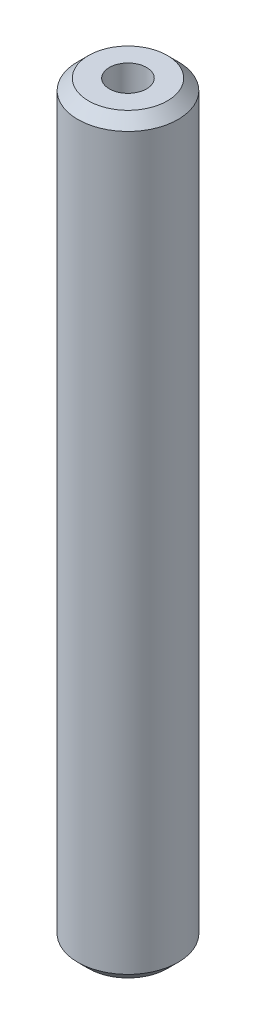
ISO-10303-21;
HEADER;
FILE_DESCRIPTION(('STEP AP214'),'2;1');
FILE_NAME('part.step','',(''),(''),'','','');
FILE_SCHEMA(('AUTOMOTIVE_DESIGN { 1 0 10303 214 1 1 1 1 }'));
ENDSEC;
DATA;
#1=APPLICATION_CONTEXT('core data for automotive mechanical design processes');
#2=APPLICATION_PROTOCOL_DEFINITION('international standard','automotive_design',2000,#1);
#3=PRODUCT_CONTEXT('',#1,'mechanical');
#4=PRODUCT('Part','Part','',(#3));
#5=PRODUCT_RELATED_PRODUCT_CATEGORY('part','',(#4));
#6=PRODUCT_DEFINITION_FORMATION('','',#4);
#7=PRODUCT_DEFINITION_CONTEXT('part definition',#1,'design');
#8=PRODUCT_DEFINITION('design','',#6,#7);
#9=PRODUCT_DEFINITION_SHAPE('','',#8);
#10=(LENGTH_UNIT() NAMED_UNIT(*) SI_UNIT(.MILLI.,.METRE.));
#11=(NAMED_UNIT(*) PLANE_ANGLE_UNIT() SI_UNIT($,.RADIAN.));
#12=(NAMED_UNIT(*) SI_UNIT($,.STERADIAN.) SOLID_ANGLE_UNIT());
#13=UNCERTAINTY_MEASURE_WITH_UNIT(LENGTH_MEASURE(1.E-05),#10,'distance_accuracy_value','');
#14=(GEOMETRIC_REPRESENTATION_CONTEXT(3) GLOBAL_UNCERTAINTY_ASSIGNED_CONTEXT((#13)) GLOBAL_UNIT_ASSIGNED_CONTEXT((#10,
#11,#12)) REPRESENTATION_CONTEXT('',''));
#15=CARTESIAN_POINT('',(0.,0.,0.));
#16=DIRECTION('',(0.,0.,1.));
#17=DIRECTION('',(1.,0.,0.));
#18=AXIS2_PLACEMENT_3D('',#15,#16,#17);
#19=CARTESIAN_POINT('',(0.,374.822982686865,0.));
#20=DIRECTION('',(0.,-1.,0.));
#21=DIRECTION('',(0.,0.,-1.));
#22=AXIS2_PLACEMENT_3D('',#19,#20,#21);
#23=CYLINDRICAL_SURFACE('',#22,25.);
#24=CARTESIAN_POINT('',(0.,369.476556317906,0.));
#25=DIRECTION('',(0.,1.,0.));
#26=DIRECTION('',(0.,0.,1.));
#27=AXIS2_PLACEMENT_3D('',#24,#25,#26);
#28=CIRCLE('',#27,25.);
#29=CARTESIAN_POINT('',(0.,369.476556317906,25.));
#30=VERTEX_POINT('',#29);
#31=EDGE_CURVE('E50',#30,#30,#28,.F.);
#32=ORIENTED_EDGE('',*,*,#31,.T.);
#33=EDGE_LOOP('',(#32));
#34=FACE_BOUND('',#33,.T.);
#35=CARTESIAN_POINT('',(0.,5.34642636895843,0.));
#36=DIRECTION('',(0.,1.,0.));
#37=DIRECTION('',(0.,0.,1.));
#38=AXIS2_PLACEMENT_3D('',#35,#36,#37);
#39=CIRCLE('',#38,25.);
#40=CARTESIAN_POINT('',(0.,5.34642636895843,25.));
#41=VERTEX_POINT('',#40);
#42=EDGE_CURVE('E51',#41,#41,#39,.T.);
#43=ORIENTED_EDGE('',*,*,#42,.T.);
#44=EDGE_LOOP('',(#43));
#45=FACE_BOUND('',#44,.T.);
#46=ADVANCED_FACE('F39',(#34,#45),#23,.T.);
#47=CARTESIAN_POINT('',(0.,374.822982686865,0.));
#48=DIRECTION('',(0.,1.,0.));
#49=DIRECTION('',(0.,0.,1.));
#50=AXIS2_PLACEMENT_3D('',#47,#48,#49);
#51=PLANE('',#50);
#52=CARTESIAN_POINT('',(0.,374.822982686865,0.));
#53=DIRECTION('',(0.,1.,0.));
#54=DIRECTION('',(0.,0.,1.));
#55=AXIS2_PLACEMENT_3D('',#52,#53,#54);
#56=CIRCLE('',#55,19.6535736310415);
#57=CARTESIAN_POINT('',(0.,374.822982686865,19.6535736310415));
#58=VERTEX_POINT('',#57);
#59=EDGE_CURVE('E54',#58,#58,#56,.T.);
#60=ORIENTED_EDGE('',*,*,#59,.T.);
#61=EDGE_LOOP('',(#60));
#62=FACE_BOUND('',#61,.T.);
#63=CARTESIAN_POINT('',(0.,374.822982686865,0.));
#64=DIRECTION('',(0.,1.,0.));
#65=DIRECTION('',(0.,0.,1.));
#66=AXIS2_PLACEMENT_3D('',#63,#64,#65);
#67=CIRCLE('',#66,9.28684131302457);
#68=CARTESIAN_POINT('',(0.,374.822982686865,9.28684131302457));
#69=VERTEX_POINT('',#68);
#70=EDGE_CURVE('E58',#69,#69,#67,.T.);
#71=ORIENTED_EDGE('',*,*,#70,.F.);
#72=EDGE_LOOP('',(#71));
#73=FACE_BOUND('',#72,.T.);
#74=ADVANCED_FACE('F69',(#62,#73),#51,.T.);
#75=CARTESIAN_POINT('',(0.,0.,0.));
#76=DIRECTION('',(0.,1.,0.));
#77=DIRECTION('',(0.,0.,1.));
#78=AXIS2_PLACEMENT_3D('',#75,#76,#77);
#79=PLANE('',#78);
#80=CARTESIAN_POINT('',(0.,0.,0.));
#81=DIRECTION('',(0.,1.,0.));
#82=DIRECTION('',(0.,0.,1.));
#83=AXIS2_PLACEMENT_3D('',#80,#81,#82);
#84=CIRCLE('',#83,19.6535736310415);
#85=CARTESIAN_POINT('',(0.,0.,19.6535736310415));
#86=VERTEX_POINT('',#85);
#87=EDGE_CURVE('E10',#86,#86,#84,.F.);
#88=ORIENTED_EDGE('',*,*,#87,.T.);
#89=EDGE_LOOP('',(#88));
#90=FACE_BOUND('',#89,.T.);
#91=CARTESIAN_POINT('',(0.,0.,0.));
#92=DIRECTION('',(0.,1.,0.));
#93=DIRECTION('',(0.,0.,1.));
#94=AXIS2_PLACEMENT_3D('',#91,#92,#93);
#95=CIRCLE('',#94,9.28684131302457);
#96=CARTESIAN_POINT('',(0.,0.,9.28684131302457));
#97=VERTEX_POINT('',#96);
#98=EDGE_CURVE('E63',#97,#97,#95,.T.);
#99=ORIENTED_EDGE('',*,*,#98,.T.);
#100=EDGE_LOOP('',(#99));
#101=FACE_BOUND('',#100,.T.);
#102=ADVANCED_FACE('F75',(#90,#101),#79,.F.);
#103=CARTESIAN_POINT('',(0.,374.822982686865,0.));
#104=DIRECTION('',(0.,-1.,0.));
#105=DIRECTION('',(0.,0.,-1.));
#106=AXIS2_PLACEMENT_3D('',#103,#104,#105);
#107=CYLINDRICAL_SURFACE('',#106,9.28684131302457);
#108=ORIENTED_EDGE('',*,*,#70,.T.);
#109=EDGE_LOOP('',(#108));
#110=FACE_BOUND('',#109,.T.);
#111=ORIENTED_EDGE('',*,*,#98,.F.);
#112=EDGE_LOOP('',(#111));
#113=FACE_BOUND('',#112,.T.);
#114=ADVANCED_FACE('F70',(#110,#113),#107,.F.);
#115=CARTESIAN_POINT('',(0.,374.822982686865,0.));
#116=DIRECTION('',(0.,-1.,0.));
#117=DIRECTION('',(0.,0.,-1.));
#118=AXIS2_PLACEMENT_3D('',#115,#116,#117);
#119=CONICAL_SURFACE('',#118,19.6535736310415,0.785398163397441);
#120=ORIENTED_EDGE('',*,*,#31,.F.);
#121=EDGE_LOOP('',(#120));
#122=FACE_BOUND('',#121,.T.);
#123=ORIENTED_EDGE('',*,*,#59,.F.);
#124=EDGE_LOOP('',(#123));
#125=FACE_BOUND('',#124,.T.);
#126=ADVANCED_FACE('F81',(#122,#125),#119,.T.);
#127=CARTESIAN_POINT('',(0.,5.34642636895843,0.));
#128=DIRECTION('',(0.,1.,0.));
#129=DIRECTION('',(0.,0.,1.));
#130=AXIS2_PLACEMENT_3D('',#127,#128,#129);
#131=CONICAL_SURFACE('',#130,25.,0.785398163397451);
#132=ORIENTED_EDGE('',*,*,#87,.F.);
#133=EDGE_LOOP('',(#132));
#134=FACE_BOUND('',#133,.T.);
#135=ORIENTED_EDGE('',*,*,#42,.F.);
#136=EDGE_LOOP('',(#135));
#137=FACE_BOUND('',#136,.T.);
#138=ADVANCED_FACE('F45',(#134,#137),#131,.T.);
#139=CLOSED_SHELL('',(#46,#74,#102,#114,#126,#138));
#140=MANIFOLD_SOLID_BREP('B2',#139);
#141=ADVANCED_BREP_SHAPE_REPRESENTATION('',(#18,#140),#14);
#142=SHAPE_DEFINITION_REPRESENTATION(#9,#141);
ENDSEC;
END-ISO-10303-21;
